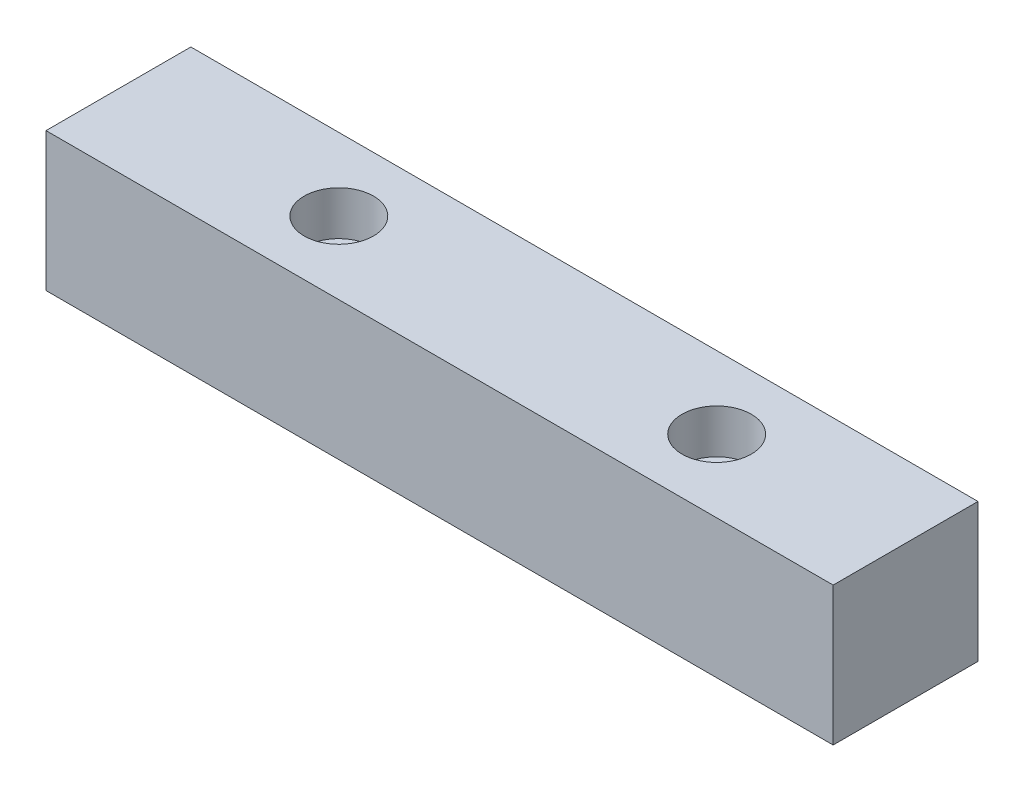
ISO-10303-21;
HEADER;
FILE_DESCRIPTION(('STEP AP214'),'2;1');
FILE_NAME('part.step','',(''),(''),'','','');
FILE_SCHEMA(('AUTOMOTIVE_DESIGN { 1 0 10303 214 1 1 1 1 }'));
ENDSEC;
DATA;
#1=APPLICATION_CONTEXT('core data for automotive mechanical design processes');
#2=APPLICATION_PROTOCOL_DEFINITION('international standard','automotive_design',2000,#1);
#3=PRODUCT_CONTEXT('',#1,'mechanical');
#4=PRODUCT('Part','Part','',(#3));
#5=PRODUCT_RELATED_PRODUCT_CATEGORY('part','',(#4));
#6=PRODUCT_DEFINITION_FORMATION('','',#4);
#7=PRODUCT_DEFINITION_CONTEXT('part definition',#1,'design');
#8=PRODUCT_DEFINITION('design','',#6,#7);
#9=PRODUCT_DEFINITION_SHAPE('','',#8);
#10=(LENGTH_UNIT() NAMED_UNIT(*) SI_UNIT(.MILLI.,.METRE.));
#11=(NAMED_UNIT(*) PLANE_ANGLE_UNIT() SI_UNIT($,.RADIAN.));
#12=(NAMED_UNIT(*) SI_UNIT($,.STERADIAN.) SOLID_ANGLE_UNIT());
#13=UNCERTAINTY_MEASURE_WITH_UNIT(LENGTH_MEASURE(1.E-05),#10,'distance_accuracy_value','');
#14=(GEOMETRIC_REPRESENTATION_CONTEXT(3) GLOBAL_UNCERTAINTY_ASSIGNED_CONTEXT((#13)) GLOBAL_UNIT_ASSIGNED_CONTEXT((#10,
#11,#12)) REPRESENTATION_CONTEXT('',''));
#15=CARTESIAN_POINT('',(0.,0.,0.));
#16=DIRECTION('',(0.,0.,1.));
#17=DIRECTION('',(1.,0.,0.));
#18=AXIS2_PLACEMENT_3D('',#15,#16,#17);
#19=CARTESIAN_POINT('',(125.,-11.,11.5));
#20=DIRECTION('',(0.,0.,-1.));
#21=DIRECTION('',(1.,0.,0.));
#22=AXIS2_PLACEMENT_3D('',#19,#20,#21);
#23=PLANE('',#22);
#24=DIRECTION('',(0.,1.,0.));
#25=VECTOR('',#24,1.);
#26=CARTESIAN_POINT('',(0.,-11.,11.5));
#27=LINE('',#26,#25);
#28=CARTESIAN_POINT('',(0.,-11.,11.5));
#29=VERTEX_POINT('',#28);
#30=CARTESIAN_POINT('',(0.,11.,11.5));
#31=VERTEX_POINT('',#30);
#32=EDGE_CURVE('E101',#29,#31,#27,.T.);
#33=ORIENTED_EDGE('',*,*,#32,.F.);
#34=DIRECTION('',(-1.,0.,0.));
#35=VECTOR('',#34,1.);
#36=CARTESIAN_POINT('',(125.,-11.,11.5));
#37=LINE('',#36,#35);
#38=CARTESIAN_POINT('',(125.,-11.,11.5));
#39=VERTEX_POINT('',#38);
#40=EDGE_CURVE('E100',#39,#29,#37,.T.);
#41=ORIENTED_EDGE('',*,*,#40,.F.);
#42=DIRECTION('',(0.,1.,0.));
#43=VECTOR('',#42,1.);
#44=CARTESIAN_POINT('',(125.,-11.,11.5));
#45=LINE('',#44,#43);
#46=CARTESIAN_POINT('',(125.,11.,11.5));
#47=VERTEX_POINT('',#46);
#48=EDGE_CURVE('E94',#39,#47,#45,.T.);
#49=ORIENTED_EDGE('',*,*,#48,.T.);
#50=DIRECTION('',(-1.,0.,0.));
#51=VECTOR('',#50,1.);
#52=CARTESIAN_POINT('',(125.,11.,11.5));
#53=LINE('',#52,#51);
#54=EDGE_CURVE('E11',#47,#31,#53,.T.);
#55=ORIENTED_EDGE('',*,*,#54,.T.);
#56=EDGE_LOOP('',(#33,#41,#49,#55));
#57=FACE_BOUND('',#56,.T.);
#58=ADVANCED_FACE('F37',(#57),#23,.F.);
#59=CARTESIAN_POINT('',(125.,11.,-11.5));
#60=DIRECTION('',(0.,-1.,0.));
#61=DIRECTION('',(0.,0.,1.));
#62=AXIS2_PLACEMENT_3D('',#59,#60,#61);
#63=PLANE('',#62);
#64=CARTESIAN_POINT('',(95.,11.,0.));
#65=DIRECTION('',(0.,-1.,0.));
#66=DIRECTION('',(0.,0.,-1.));
#67=AXIS2_PLACEMENT_3D('',#64,#65,#66);
#68=CIRCLE('',#67,5.50000000000001);
#69=CARTESIAN_POINT('',(95.,11.,-5.50000000000001));
#70=VERTEX_POINT('',#69);
#71=EDGE_CURVE('E136',#70,#70,#68,.T.);
#72=ORIENTED_EDGE('',*,*,#71,.T.);
#73=EDGE_LOOP('',(#72));
#74=FACE_BOUND('',#73,.T.);
#75=CARTESIAN_POINT('',(35.,11.,0.));
#76=DIRECTION('',(0.,-1.,0.));
#77=DIRECTION('',(0.,0.,-1.));
#78=AXIS2_PLACEMENT_3D('',#75,#76,#77);
#79=CIRCLE('',#78,5.5);
#80=CARTESIAN_POINT('',(35.,11.,-5.5));
#81=VERTEX_POINT('',#80);
#82=EDGE_CURVE('E139',#81,#81,#79,.T.);
#83=ORIENTED_EDGE('',*,*,#82,.T.);
#84=EDGE_LOOP('',(#83));
#85=FACE_BOUND('',#84,.T.);
#86=DIRECTION('',(0.,0.,-1.));
#87=VECTOR('',#86,1.);
#88=CARTESIAN_POINT('',(0.,11.,-11.5));
#89=LINE('',#88,#87);
#90=CARTESIAN_POINT('',(0.,11.,-11.5));
#91=VERTEX_POINT('',#90);
#92=EDGE_CURVE('E103',#31,#91,#89,.T.);
#93=ORIENTED_EDGE('',*,*,#92,.F.);
#94=ORIENTED_EDGE('',*,*,#54,.F.);
#95=DIRECTION('',(0.,0.,-1.));
#96=VECTOR('',#95,1.);
#97=CARTESIAN_POINT('',(125.,11.,-11.5));
#98=LINE('',#97,#96);
#99=CARTESIAN_POINT('',(125.,11.,-11.5));
#100=VERTEX_POINT('',#99);
#101=EDGE_CURVE('E78',#47,#100,#98,.T.);
#102=ORIENTED_EDGE('',*,*,#101,.T.);
#103=DIRECTION('',(-1.,0.,0.));
#104=VECTOR('',#103,1.);
#105=CARTESIAN_POINT('',(125.,11.,-11.5));
#106=LINE('',#105,#104);
#107=EDGE_CURVE('E45',#100,#91,#106,.T.);
#108=ORIENTED_EDGE('',*,*,#107,.T.);
#109=EDGE_LOOP('',(#93,#94,#102,#108));
#110=FACE_BOUND('',#109,.T.);
#111=ADVANCED_FACE('F92',(#74,#85,#110),#63,.F.);
#112=CARTESIAN_POINT('',(125.,-11.,-11.5));
#113=DIRECTION('',(0.,0.,1.));
#114=DIRECTION('',(-1.,0.,0.));
#115=AXIS2_PLACEMENT_3D('',#112,#113,#114);
#116=PLANE('',#115);
#117=DIRECTION('',(0.,-1.,0.));
#118=VECTOR('',#117,1.);
#119=CARTESIAN_POINT('',(0.,-11.,-11.5));
#120=LINE('',#119,#118);
#121=CARTESIAN_POINT('',(0.,-11.,-11.5));
#122=VERTEX_POINT('',#121);
#123=EDGE_CURVE('E88',#91,#122,#120,.T.);
#124=ORIENTED_EDGE('',*,*,#123,.F.);
#125=ORIENTED_EDGE('',*,*,#107,.F.);
#126=DIRECTION('',(0.,-1.,0.));
#127=VECTOR('',#126,1.);
#128=CARTESIAN_POINT('',(125.,-11.,-11.5));
#129=LINE('',#128,#127);
#130=CARTESIAN_POINT('',(125.,-11.,-11.5));
#131=VERTEX_POINT('',#130);
#132=EDGE_CURVE('E81',#100,#131,#129,.T.);
#133=ORIENTED_EDGE('',*,*,#132,.T.);
#134=DIRECTION('',(-1.,0.,0.));
#135=VECTOR('',#134,1.);
#136=CARTESIAN_POINT('',(125.,-11.,-11.5));
#137=LINE('',#136,#135);
#138=EDGE_CURVE('E91',#131,#122,#137,.T.);
#139=ORIENTED_EDGE('',*,*,#138,.T.);
#140=EDGE_LOOP('',(#124,#125,#133,#139));
#141=FACE_BOUND('',#140,.T.);
#142=ADVANCED_FACE('F87',(#141),#116,.F.);
#143=CARTESIAN_POINT('',(125.,-11.,-11.5));
#144=DIRECTION('',(0.,1.,0.));
#145=DIRECTION('',(0.,0.,-1.));
#146=AXIS2_PLACEMENT_3D('',#143,#144,#145);
#147=PLANE('',#146);
#148=CARTESIAN_POINT('',(95.,-11.,0.));
#149=DIRECTION('',(0.,-1.,0.));
#150=DIRECTION('',(0.,0.,-1.));
#151=AXIS2_PLACEMENT_3D('',#148,#149,#150);
#152=CIRCLE('',#151,3.24999999999999);
#153=CARTESIAN_POINT('',(95.,-11.,-3.24999999999999));
#154=VERTEX_POINT('',#153);
#155=EDGE_CURVE('E142',#154,#154,#152,.T.);
#156=ORIENTED_EDGE('',*,*,#155,.F.);
#157=EDGE_LOOP('',(#156));
#158=FACE_BOUND('',#157,.T.);
#159=CARTESIAN_POINT('',(35.,-11.,0.));
#160=DIRECTION('',(0.,-1.,0.));
#161=DIRECTION('',(0.,0.,-1.));
#162=AXIS2_PLACEMENT_3D('',#159,#160,#161);
#163=CIRCLE('',#162,3.25);
#164=CARTESIAN_POINT('',(35.,-11.,-3.25));
#165=VERTEX_POINT('',#164);
#166=EDGE_CURVE('E104',#165,#165,#163,.T.);
#167=ORIENTED_EDGE('',*,*,#166,.F.);
#168=EDGE_LOOP('',(#167));
#169=FACE_BOUND('',#168,.T.);
#170=DIRECTION('',(0.,0.,1.));
#171=VECTOR('',#170,1.);
#172=CARTESIAN_POINT('',(0.,-11.,-11.5));
#173=LINE('',#172,#171);
#174=EDGE_CURVE('E67',#122,#29,#173,.T.);
#175=ORIENTED_EDGE('',*,*,#174,.F.);
#176=ORIENTED_EDGE('',*,*,#138,.F.);
#177=DIRECTION('',(0.,0.,1.));
#178=VECTOR('',#177,1.);
#179=CARTESIAN_POINT('',(125.,-11.,-11.5));
#180=LINE('',#179,#178);
#181=EDGE_CURVE('E53',#131,#39,#180,.T.);
#182=ORIENTED_EDGE('',*,*,#181,.T.);
#183=ORIENTED_EDGE('',*,*,#40,.T.);
#184=EDGE_LOOP('',(#175,#176,#182,#183));
#185=FACE_BOUND('',#184,.T.);
#186=ADVANCED_FACE('F113',(#158,#169,#185),#147,.F.);
#187=CARTESIAN_POINT('',(125.,0.,0.));
#188=DIRECTION('',(-1.,0.,0.));
#189=DIRECTION('',(0.,0.,-1.));
#190=AXIS2_PLACEMENT_3D('',#187,#188,#189);
#191=PLANE('',#190);
#192=ORIENTED_EDGE('',*,*,#48,.F.);
#193=ORIENTED_EDGE('',*,*,#181,.F.);
#194=ORIENTED_EDGE('',*,*,#132,.F.);
#195=ORIENTED_EDGE('',*,*,#101,.F.);
#196=EDGE_LOOP('',(#192,#193,#194,#195));
#197=FACE_BOUND('',#196,.T.);
#198=ADVANCED_FACE('F83',(#197),#191,.F.);
#199=CARTESIAN_POINT('',(0.,0.,0.));
#200=DIRECTION('',(-1.,0.,0.));
#201=DIRECTION('',(0.,0.,-1.));
#202=AXIS2_PLACEMENT_3D('',#199,#200,#201);
#203=PLANE('',#202);
#204=ORIENTED_EDGE('',*,*,#32,.T.);
#205=ORIENTED_EDGE('',*,*,#92,.T.);
#206=ORIENTED_EDGE('',*,*,#123,.T.);
#207=ORIENTED_EDGE('',*,*,#174,.T.);
#208=EDGE_LOOP('',(#204,#205,#206,#207));
#209=FACE_BOUND('',#208,.T.);
#210=ADVANCED_FACE('F109',(#209),#203,.T.);
#211=CARTESIAN_POINT('',(35.,11.,0.));
#212=DIRECTION('',(0.,1.,0.));
#213=DIRECTION('',(0.,0.,-1.));
#214=AXIS2_PLACEMENT_3D('',#211,#212,#213);
#215=CYLINDRICAL_SURFACE('',#214,3.25);
#216=ORIENTED_EDGE('',*,*,#166,.T.);
#217=EDGE_LOOP('',(#216));
#218=FACE_BOUND('',#217,.T.);
#219=CARTESIAN_POINT('',(35.,4.,0.));
#220=DIRECTION('',(0.,-1.,0.));
#221=DIRECTION('',(0.,0.,-1.));
#222=AXIS2_PLACEMENT_3D('',#219,#220,#221);
#223=CIRCLE('',#222,3.25);
#224=CARTESIAN_POINT('',(35.,4.,-3.25));
#225=VERTEX_POINT('',#224);
#226=EDGE_CURVE('E145',#225,#225,#223,.T.);
#227=ORIENTED_EDGE('',*,*,#226,.F.);
#228=EDGE_LOOP('',(#227));
#229=FACE_BOUND('',#228,.T.);
#230=ADVANCED_FACE('F156',(#218,#229),#215,.F.);
#231=CARTESIAN_POINT('',(38.25,4.,0.));
#232=DIRECTION('',(0.,-1.,0.));
#233=DIRECTION('',(0.,0.,1.));
#234=AXIS2_PLACEMENT_3D('',#231,#232,#233);
#235=PLANE('',#234);
#236=ORIENTED_EDGE('',*,*,#226,.T.);
#237=EDGE_LOOP('',(#236));
#238=FACE_BOUND('',#237,.T.);
#239=CARTESIAN_POINT('',(35.,4.,0.));
#240=DIRECTION('',(0.,-1.,0.));
#241=DIRECTION('',(0.,0.,-1.));
#242=AXIS2_PLACEMENT_3D('',#239,#240,#241);
#243=CIRCLE('',#242,5.5);
#244=CARTESIAN_POINT('',(35.,4.,-5.5));
#245=VERTEX_POINT('',#244);
#246=EDGE_CURVE('E141',#245,#245,#243,.T.);
#247=ORIENTED_EDGE('',*,*,#246,.F.);
#248=EDGE_LOOP('',(#247));
#249=FACE_BOUND('',#248,.T.);
#250=ADVANCED_FACE('F159',(#238,#249),#235,.F.);
#251=CARTESIAN_POINT('',(35.,11.,0.));
#252=DIRECTION('',(0.,1.,0.));
#253=DIRECTION('',(0.,0.,-1.));
#254=AXIS2_PLACEMENT_3D('',#251,#252,#253);
#255=CYLINDRICAL_SURFACE('',#254,5.5);
#256=ORIENTED_EDGE('',*,*,#246,.T.);
#257=EDGE_LOOP('',(#256));
#258=FACE_BOUND('',#257,.T.);
#259=ORIENTED_EDGE('',*,*,#82,.F.);
#260=EDGE_LOOP('',(#259));
#261=FACE_BOUND('',#260,.T.);
#262=ADVANCED_FACE('F165',(#258,#261),#255,.F.);
#263=CARTESIAN_POINT('',(95.,11.,0.));
#264=DIRECTION('',(0.,1.,0.));
#265=DIRECTION('',(0.,0.,-1.));
#266=AXIS2_PLACEMENT_3D('',#263,#264,#265);
#267=CYLINDRICAL_SURFACE('',#266,3.25);
#268=ORIENTED_EDGE('',*,*,#155,.T.);
#269=EDGE_LOOP('',(#268));
#270=FACE_BOUND('',#269,.T.);
#271=CARTESIAN_POINT('',(95.,4.,0.));
#272=DIRECTION('',(0.,-1.,0.));
#273=DIRECTION('',(0.,0.,-1.));
#274=AXIS2_PLACEMENT_3D('',#271,#272,#273);
#275=CIRCLE('',#274,3.25);
#276=CARTESIAN_POINT('',(95.,4.,-3.25));
#277=VERTEX_POINT('',#276);
#278=EDGE_CURVE('E148',#277,#277,#275,.T.);
#279=ORIENTED_EDGE('',*,*,#278,.F.);
#280=EDGE_LOOP('',(#279));
#281=FACE_BOUND('',#280,.T.);
#282=ADVANCED_FACE('F170',(#270,#281),#267,.F.);
#283=CARTESIAN_POINT('',(98.25,4.,0.));
#284=DIRECTION('',(0.,-1.,0.));
#285=DIRECTION('',(0.,0.,1.));
#286=AXIS2_PLACEMENT_3D('',#283,#284,#285);
#287=PLANE('',#286);
#288=ORIENTED_EDGE('',*,*,#278,.T.);
#289=EDGE_LOOP('',(#288));
#290=FACE_BOUND('',#289,.T.);
#291=CARTESIAN_POINT('',(95.,4.,0.));
#292=DIRECTION('',(0.,-1.,0.));
#293=DIRECTION('',(0.,0.,-1.));
#294=AXIS2_PLACEMENT_3D('',#291,#292,#293);
#295=CIRCLE('',#294,5.50000000000001);
#296=CARTESIAN_POINT('',(95.,4.,-5.50000000000001));
#297=VERTEX_POINT('',#296);
#298=EDGE_CURVE('E227',#297,#297,#295,.T.);
#299=ORIENTED_EDGE('',*,*,#298,.F.);
#300=EDGE_LOOP('',(#299));
#301=FACE_BOUND('',#300,.T.);
#302=ADVANCED_FACE('F175',(#290,#301),#287,.F.);
#303=CARTESIAN_POINT('',(95.,11.,0.));
#304=DIRECTION('',(0.,1.,0.));
#305=DIRECTION('',(0.,0.,-1.));
#306=AXIS2_PLACEMENT_3D('',#303,#304,#305);
#307=CYLINDRICAL_SURFACE('',#306,5.50000000000001);
#308=ORIENTED_EDGE('',*,*,#298,.T.);
#309=EDGE_LOOP('',(#308));
#310=FACE_BOUND('',#309,.T.);
#311=ORIENTED_EDGE('',*,*,#71,.F.);
#312=EDGE_LOOP('',(#311));
#313=FACE_BOUND('',#312,.T.);
#314=ADVANCED_FACE('F211',(#310,#313),#307,.F.);
#315=CLOSED_SHELL('',(#58,#111,#142,#186,#198,#210,#230,#250,#262,#282,#302,#314));
#316=MANIFOLD_SOLID_BREP('B2',#315);
#317=ADVANCED_BREP_SHAPE_REPRESENTATION('',(#18,#316),#14);
#318=SHAPE_DEFINITION_REPRESENTATION(#9,#317);
ENDSEC;
END-ISO-10303-21;
